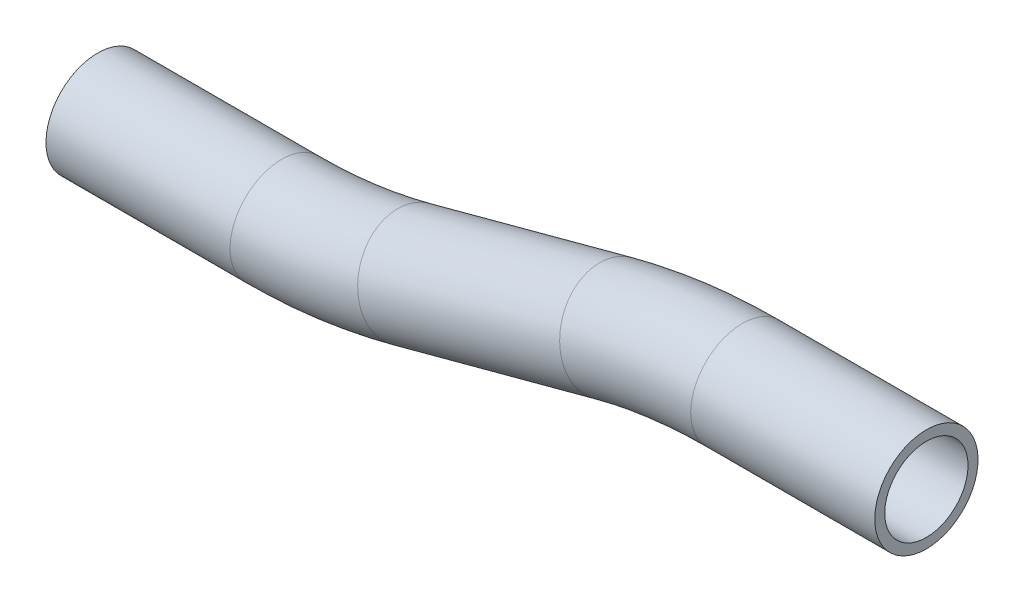
ISO-10303-21;
HEADER;
FILE_DESCRIPTION(('STEP AP214'),'2;1');
FILE_NAME('part.step','',(''),(''),'','','');
FILE_SCHEMA(('AUTOMOTIVE_DESIGN { 1 0 10303 214 1 1 1 1 }'));
ENDSEC;
DATA;
#1=APPLICATION_CONTEXT('core data for automotive mechanical design processes');
#2=APPLICATION_PROTOCOL_DEFINITION('international standard','automotive_design',2000,#1);
#3=PRODUCT_CONTEXT('',#1,'mechanical');
#4=PRODUCT('Part','Part','',(#3));
#5=PRODUCT_RELATED_PRODUCT_CATEGORY('part','',(#4));
#6=PRODUCT_DEFINITION_FORMATION('','',#4);
#7=PRODUCT_DEFINITION_CONTEXT('part definition',#1,'design');
#8=PRODUCT_DEFINITION('design','',#6,#7);
#9=PRODUCT_DEFINITION_SHAPE('','',#8);
#10=(LENGTH_UNIT() NAMED_UNIT(*) SI_UNIT(.MILLI.,.METRE.));
#11=(NAMED_UNIT(*) PLANE_ANGLE_UNIT() SI_UNIT($,.RADIAN.));
#12=(NAMED_UNIT(*) SI_UNIT($,.STERADIAN.) SOLID_ANGLE_UNIT());
#13=UNCERTAINTY_MEASURE_WITH_UNIT(LENGTH_MEASURE(1.E-05),#10,'distance_accuracy_value','');
#14=(GEOMETRIC_REPRESENTATION_CONTEXT(3) GLOBAL_UNCERTAINTY_ASSIGNED_CONTEXT((#13)) GLOBAL_UNIT_ASSIGNED_CONTEXT((#10,
#11,#12)) REPRESENTATION_CONTEXT('',''));
#15=CARTESIAN_POINT('',(0.,0.,0.));
#16=DIRECTION('',(0.,0.,1.));
#17=DIRECTION('',(1.,0.,0.));
#18=AXIS2_PLACEMENT_3D('',#15,#16,#17);
#19=CARTESIAN_POINT('',(28.0680796838404,0.,0.));
#20=DIRECTION('',(-1.,0.,0.));
#21=DIRECTION('',(0.,-1.,0.));
#22=AXIS2_PLACEMENT_3D('',#19,#20,#21);
#23=CYLINDRICAL_SURFACE('',#22,7.874);
#24=CARTESIAN_POINT('',(0.,0.,0.));
#25=DIRECTION('',(-1.,0.,0.));
#26=DIRECTION('',(0.,-1.,0.));
#27=AXIS2_PLACEMENT_3D('',#24,#25,#26);
#28=CIRCLE('',#27,7.874);
#29=CARTESIAN_POINT('',(0.,7.87399999999996,0.));
#30=VERTEX_POINT('',#29);
#31=EDGE_CURVE('E60',#30,#30,#28,.T.);
#32=ORIENTED_EDGE('',*,*,#31,.F.);
#33=EDGE_LOOP('',(#32));
#34=FACE_BOUND('',#33,.T.);
#35=CARTESIAN_POINT('',(28.0680796838404,0.,0.));
#36=DIRECTION('',(-1.,0.,0.));
#37=DIRECTION('',(0.,-1.,0.));
#38=AXIS2_PLACEMENT_3D('',#35,#36,#37);
#39=CIRCLE('',#38,7.874);
#40=CARTESIAN_POINT('',(28.0680796838404,-7.874,0.));
#41=VERTEX_POINT('',#40);
#42=EDGE_CURVE('E57',#41,#41,#39,.T.);
#43=ORIENTED_EDGE('',*,*,#42,.T.);
#44=EDGE_LOOP('',(#43));
#45=FACE_BOUND('',#44,.T.);
#46=ADVANCED_FACE('F36',(#34,#45),#23,.T.);
#47=CARTESIAN_POINT('',(0.,-76.2,0.));
#48=DIRECTION('',(0.,0.,1.));
#49=DIRECTION('',(1.,0.,0.));
#50=AXIS2_PLACEMENT_3D('',#47,#48,#49);
#51=TOROIDAL_SURFACE('',#50,76.2,7.874);
#52=CARTESIAN_POINT('',(-19.7220112368122,-2.59645203677303,0.));
#53=DIRECTION('',(-0.965925826289068,-0.258819045102522,0.));
#54=DIRECTION('',(0.258819045102522,-0.965925826289068,0.));
#55=AXIS2_PLACEMENT_3D('',#52,#53,#54);
#56=CIRCLE('',#55,7.874);
#57=CARTESIAN_POINT('',(-21.7599523979494,5.00924791942708,0.));
#58=VERTEX_POINT('',#57);
#59=EDGE_CURVE('E63',#58,#58,#56,.T.);
#60=CARTESIAN_POINT('',(0.,-76.2,0.));
#61=DIRECTION('',(0.,0.,1.));
#62=DIRECTION('',(1.,0.,0.));
#63=AXIS2_PLACEMENT_3D('',#60,#61,#62);
#64=CIRCLE('',#63,84.074);
#65=EDGE_CURVE('',#30,#58,#64,.T.);
#66=ORIENTED_EDGE('',*,*,#31,.T.);
#67=ORIENTED_EDGE('',*,*,#59,.F.);
#68=ORIENTED_EDGE('',*,*,#65,.T.);
#69=ORIENTED_EDGE('',*,*,#65,.F.);
#70=EDGE_LOOP('',(#66,#68,#67,#69));
#71=FACE_BOUND('',#70,.T.);
#72=ADVANCED_FACE('F82',(#71),#51,.T.);
#73=CARTESIAN_POINT('',(-19.7220112368122,-2.59645203677303,0.));
#74=DIRECTION('',(-0.965925826289068,-0.258819045102522,0.));
#75=DIRECTION('',(0.258819045102522,-0.965925826289068,0.));
#76=AXIS2_PLACEMENT_3D('',#73,#74,#75);
#77=CYLINDRICAL_SURFACE('',#76,7.874);
#78=CARTESIAN_POINT('',(-50.5239923613557,-10.8498180043732,0.));
#79=DIRECTION('',(-0.965925826289068,-0.258819045102522,0.));
#80=DIRECTION('',(0.258819045102522,-0.965925826289068,0.));
#81=AXIS2_PLACEMENT_3D('',#78,#79,#80);
#82=CIRCLE('',#81,7.874);
#83=CARTESIAN_POINT('',(-48.4860512002184,-18.4555179605733,0.));
#84=VERTEX_POINT('',#83);
#85=EDGE_CURVE('E65',#84,#84,#82,.T.);
#86=ORIENTED_EDGE('',*,*,#85,.F.);
#87=EDGE_LOOP('',(#86));
#88=FACE_BOUND('',#87,.T.);
#89=ORIENTED_EDGE('',*,*,#59,.T.);
#90=EDGE_LOOP('',(#89));
#91=FACE_BOUND('',#90,.T.);
#92=ADVANCED_FACE('F75',(#88,#91),#77,.T.);
#93=CARTESIAN_POINT('',(-70.2460035981678,62.7537299588538,0.));
#94=DIRECTION('',(0.,0.,-1.));
#95=DIRECTION('',(-1.,0.,0.));
#96=AXIS2_PLACEMENT_3D('',#93,#94,#95);
#97=TOROIDAL_SURFACE('',#96,76.2,7.874);
#98=CARTESIAN_POINT('',(-70.2460035981677,-13.4462700411462,0.));
#99=DIRECTION('',(-1.,0.,0.));
#100=DIRECTION('',(0.,-1.,0.));
#101=AXIS2_PLACEMENT_3D('',#98,#99,#100);
#102=CIRCLE('',#101,7.874);
#103=CARTESIAN_POINT('',(-70.2460035981677,-21.3202700411462,0.));
#104=VERTEX_POINT('',#103);
#105=EDGE_CURVE('E40',#104,#104,#102,.T.);
#106=CARTESIAN_POINT('',(-70.2460035981678,62.7537299588538,0.));
#107=DIRECTION('',(0.,0.,-1.));
#108=DIRECTION('',(-1.,0.,0.));
#109=AXIS2_PLACEMENT_3D('',#106,#107,#108);
#110=CIRCLE('',#109,84.074);
#111=EDGE_CURVE('',#84,#104,#110,.T.);
#112=ORIENTED_EDGE('',*,*,#85,.T.);
#113=ORIENTED_EDGE('',*,*,#105,.F.);
#114=ORIENTED_EDGE('',*,*,#111,.T.);
#115=ORIENTED_EDGE('',*,*,#111,.F.);
#116=EDGE_LOOP('',(#112,#114,#113,#115));
#117=FACE_BOUND('',#116,.T.);
#118=ADVANCED_FACE('F73',(#117),#97,.T.);
#119=CARTESIAN_POINT('',(-70.2460035981677,-13.4462700411462,0.));
#120=DIRECTION('',(-1.,0.,0.));
#121=DIRECTION('',(0.,-1.,0.));
#122=AXIS2_PLACEMENT_3D('',#119,#120,#121);
#123=CYLINDRICAL_SURFACE('',#122,7.874);
#124=CARTESIAN_POINT('',(-98.3140832820081,-13.4462700411462,0.));
#125=DIRECTION('',(-1.,0.,0.));
#126=DIRECTION('',(0.,-1.,0.));
#127=AXIS2_PLACEMENT_3D('',#124,#125,#126);
#128=CIRCLE('',#127,7.874);
#129=CARTESIAN_POINT('',(-98.3140832820081,-21.3202700411462,0.));
#130=VERTEX_POINT('',#129);
#131=EDGE_CURVE('E53',#130,#130,#128,.T.);
#132=ORIENTED_EDGE('',*,*,#131,.F.);
#133=EDGE_LOOP('',(#132));
#134=FACE_BOUND('',#133,.T.);
#135=ORIENTED_EDGE('',*,*,#105,.T.);
#136=EDGE_LOOP('',(#135));
#137=FACE_BOUND('',#136,.T.);
#138=ADVANCED_FACE('F38',(#134,#137),#123,.T.);
#139=CARTESIAN_POINT('',(28.0680796838404,0.,0.));
#140=DIRECTION('',(-1.,0.,0.));
#141=DIRECTION('',(0.,-1.,0.));
#142=AXIS2_PLACEMENT_3D('',#139,#140,#141);
#143=PLANE('',#142);
#144=CARTESIAN_POINT('',(28.0680796838404,0.,0.));
#145=DIRECTION('',(-1.,0.,0.));
#146=DIRECTION('',(0.,-1.,0.));
#147=AXIS2_PLACEMENT_3D('',#144,#145,#146);
#148=CIRCLE('',#147,6.35);
#149=CARTESIAN_POINT('',(28.0680796838404,-6.35,0.));
#150=VERTEX_POINT('',#149);
#151=EDGE_CURVE('E56',#150,#150,#148,.F.);
#152=ORIENTED_EDGE('',*,*,#151,.F.);
#153=EDGE_LOOP('',(#152));
#154=FACE_BOUND('',#153,.T.);
#155=ORIENTED_EDGE('',*,*,#42,.F.);
#156=EDGE_LOOP('',(#155));
#157=FACE_BOUND('',#156,.T.);
#158=ADVANCED_FACE('F80',(#154,#157),#143,.F.);
#159=CARTESIAN_POINT('',(-98.3140832820081,-13.4462700411462,0.));
#160=DIRECTION('',(-1.,0.,0.));
#161=DIRECTION('',(0.,-1.,0.));
#162=AXIS2_PLACEMENT_3D('',#159,#160,#161);
#163=PLANE('',#162);
#164=CARTESIAN_POINT('',(-98.3140832820081,-13.4462700411462,0.));
#165=DIRECTION('',(-1.,0.,0.));
#166=DIRECTION('',(0.,-1.,0.));
#167=AXIS2_PLACEMENT_3D('',#164,#165,#166);
#168=CIRCLE('',#167,6.35);
#169=CARTESIAN_POINT('',(-98.3140832820081,-19.7962700411462,0.));
#170=VERTEX_POINT('',#169);
#171=EDGE_CURVE('E10',#170,#170,#168,.F.);
#172=ORIENTED_EDGE('',*,*,#171,.T.);
#173=EDGE_LOOP('',(#172));
#174=FACE_BOUND('',#173,.T.);
#175=ORIENTED_EDGE('',*,*,#131,.T.);
#176=EDGE_LOOP('',(#175));
#177=FACE_BOUND('',#176,.T.);
#178=ADVANCED_FACE('F99',(#174,#177),#163,.T.);
#179=CARTESIAN_POINT('',(28.0680796838404,0.,0.));
#180=DIRECTION('',(-1.,0.,0.));
#181=DIRECTION('',(0.,-1.,0.));
#182=AXIS2_PLACEMENT_3D('',#179,#180,#181);
#183=CYLINDRICAL_SURFACE('',#182,6.35);
#184=CARTESIAN_POINT('',(0.,0.,0.));
#185=DIRECTION('',(-1.,0.,0.));
#186=DIRECTION('',(0.,-1.,0.));
#187=AXIS2_PLACEMENT_3D('',#184,#185,#186);
#188=CIRCLE('',#187,6.35);
#189=CARTESIAN_POINT('',(0.,6.34999999999997,0.));
#190=VERTEX_POINT('',#189);
#191=EDGE_CURVE('E197',#190,#190,#188,.F.);
#192=ORIENTED_EDGE('',*,*,#191,.F.);
#193=EDGE_LOOP('',(#192));
#194=FACE_BOUND('',#193,.T.);
#195=ORIENTED_EDGE('',*,*,#151,.T.);
#196=EDGE_LOOP('',(#195));
#197=FACE_BOUND('',#196,.T.);
#198=ADVANCED_FACE('F102',(#194,#197),#183,.F.);
#199=CARTESIAN_POINT('',(0.,-76.2,0.));
#200=DIRECTION('',(0.,0.,1.));
#201=DIRECTION('',(1.,0.,0.));
#202=AXIS2_PLACEMENT_3D('',#199,#200,#201);
#203=TOROIDAL_SURFACE('',#202,76.2,6.35);
#204=CARTESIAN_POINT('',(-19.7220112368122,-2.59645203677303,0.));
#205=DIRECTION('',(-0.965925826289068,-0.258819045102522,0.));
#206=DIRECTION('',(0.258819045102522,-0.965925826289068,0.));
#207=AXIS2_PLACEMENT_3D('',#204,#205,#206);
#208=CIRCLE('',#207,6.35);
#209=CARTESIAN_POINT('',(-21.3655121732132,3.53717696016255,0.));
#210=VERTEX_POINT('',#209);
#211=EDGE_CURVE('E196',#210,#210,#208,.F.);
#212=CARTESIAN_POINT('',(0.,-76.2,0.));
#213=DIRECTION('',(0.,0.,1.));
#214=DIRECTION('',(1.,0.,0.));
#215=AXIS2_PLACEMENT_3D('',#212,#213,#214);
#216=CIRCLE('',#215,82.55);
#217=EDGE_CURVE('',#190,#210,#216,.T.);
#218=ORIENTED_EDGE('',*,*,#191,.T.);
#219=ORIENTED_EDGE('',*,*,#211,.F.);
#220=ORIENTED_EDGE('',*,*,#217,.T.);
#221=ORIENTED_EDGE('',*,*,#217,.F.);
#222=EDGE_LOOP('',(#218,#220,#219,#221));
#223=FACE_BOUND('',#222,.T.);
#224=ADVANCED_FACE('F157',(#223),#203,.F.);
#225=CARTESIAN_POINT('',(-19.7220112368122,-2.59645203677303,0.));
#226=DIRECTION('',(-0.965925826289068,-0.258819045102522,0.));
#227=DIRECTION('',(0.258819045102522,-0.965925826289068,0.));
#228=AXIS2_PLACEMENT_3D('',#225,#226,#227);
#229=CYLINDRICAL_SURFACE('',#228,6.35);
#230=CARTESIAN_POINT('',(-50.5239923613557,-10.8498180043732,0.));
#231=DIRECTION('',(-0.965925826289068,-0.258819045102522,0.));
#232=DIRECTION('',(0.258819045102522,-0.965925826289068,0.));
#233=AXIS2_PLACEMENT_3D('',#230,#231,#232);
#234=CIRCLE('',#233,6.35);
#235=CARTESIAN_POINT('',(-48.8804914249546,-16.9834470013087,0.));
#236=VERTEX_POINT('',#235);
#237=EDGE_CURVE('E49',#236,#236,#234,.F.);
#238=ORIENTED_EDGE('',*,*,#237,.F.);
#239=EDGE_LOOP('',(#238));
#240=FACE_BOUND('',#239,.T.);
#241=ORIENTED_EDGE('',*,*,#211,.T.);
#242=EDGE_LOOP('',(#241));
#243=FACE_BOUND('',#242,.T.);
#244=ADVANCED_FACE('F93',(#240,#243),#229,.F.);
#245=CARTESIAN_POINT('',(-70.2460035981678,62.7537299588538,0.));
#246=DIRECTION('',(0.,0.,-1.));
#247=DIRECTION('',(-1.,0.,0.));
#248=AXIS2_PLACEMENT_3D('',#245,#246,#247);
#249=TOROIDAL_SURFACE('',#248,76.2,6.35);
#250=CARTESIAN_POINT('',(-70.2460035981677,-13.4462700411462,0.));
#251=DIRECTION('',(-1.,0.,0.));
#252=DIRECTION('',(0.,-1.,0.));
#253=AXIS2_PLACEMENT_3D('',#250,#251,#252);
#254=CIRCLE('',#253,6.35);
#255=CARTESIAN_POINT('',(-70.2460035981677,-19.7962700411462,0.));
#256=VERTEX_POINT('',#255);
#257=EDGE_CURVE('E44',#256,#256,#254,.F.);
#258=CARTESIAN_POINT('',(-70.2460035981678,62.7537299588538,0.));
#259=DIRECTION('',(0.,0.,-1.));
#260=DIRECTION('',(-1.,0.,0.));
#261=AXIS2_PLACEMENT_3D('',#258,#259,#260);
#262=CIRCLE('',#261,82.55);
#263=EDGE_CURVE('',#236,#256,#262,.T.);
#264=ORIENTED_EDGE('',*,*,#237,.T.);
#265=ORIENTED_EDGE('',*,*,#257,.F.);
#266=ORIENTED_EDGE('',*,*,#263,.T.);
#267=ORIENTED_EDGE('',*,*,#263,.F.);
#268=EDGE_LOOP('',(#264,#266,#265,#267));
#269=FACE_BOUND('',#268,.T.);
#270=ADVANCED_FACE('F87',(#269),#249,.F.);
#271=CARTESIAN_POINT('',(-70.2460035981677,-13.4462700411462,0.));
#272=DIRECTION('',(-1.,0.,0.));
#273=DIRECTION('',(0.,-1.,0.));
#274=AXIS2_PLACEMENT_3D('',#271,#272,#273);
#275=CYLINDRICAL_SURFACE('',#274,6.35);
#276=ORIENTED_EDGE('',*,*,#171,.F.);
#277=EDGE_LOOP('',(#276));
#278=FACE_BOUND('',#277,.T.);
#279=ORIENTED_EDGE('',*,*,#257,.T.);
#280=EDGE_LOOP('',(#279));
#281=FACE_BOUND('',#280,.T.);
#282=ADVANCED_FACE('F85',(#278,#281),#275,.F.);
#283=CLOSED_SHELL('',(#46,#72,#92,#118,#138,#158,#178,#198,#224,#244,#270,#282));
#284=MANIFOLD_SOLID_BREP('B2',#283);
#285=ADVANCED_BREP_SHAPE_REPRESENTATION('',(#18,#284),#14);
#286=SHAPE_DEFINITION_REPRESENTATION(#9,#285);
ENDSEC;
END-ISO-10303-21;
